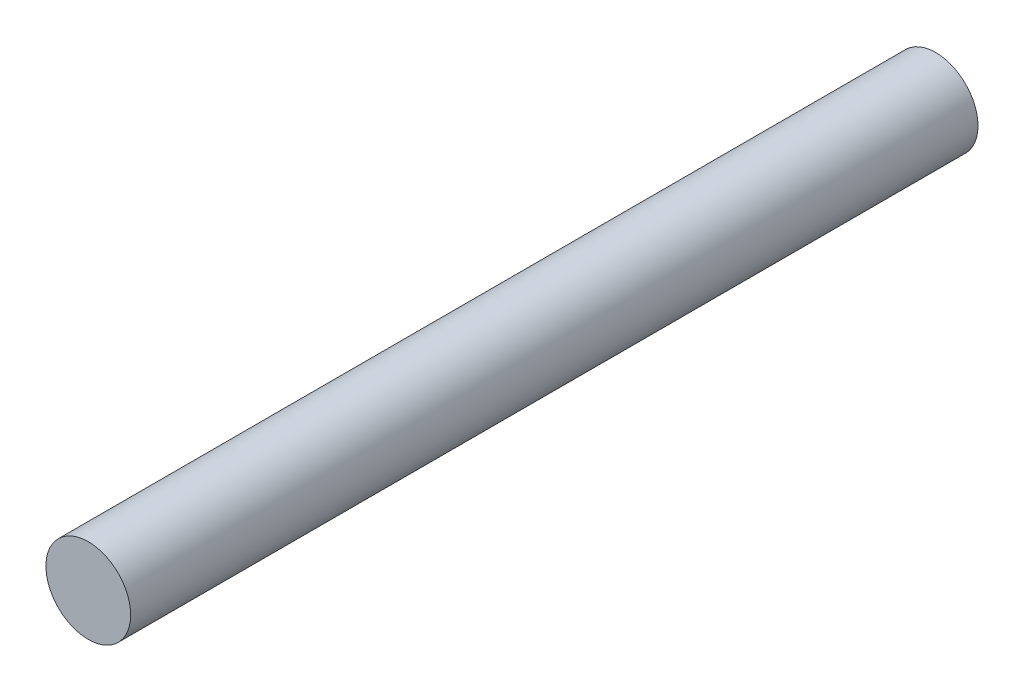
ISO-10303-21;
HEADER;
FILE_DESCRIPTION(('STEP AP214'),'2;1');
FILE_NAME('part.step','',(''),(''),'','','');
FILE_SCHEMA(('AUTOMOTIVE_DESIGN { 1 0 10303 214 1 1 1 1 }'));
ENDSEC;
DATA;
#1=APPLICATION_CONTEXT('core data for automotive mechanical design processes');
#2=APPLICATION_PROTOCOL_DEFINITION('international standard','automotive_design',2000,#1);
#3=PRODUCT_CONTEXT('',#1,'mechanical');
#4=PRODUCT('Part','Part','',(#3));
#5=PRODUCT_RELATED_PRODUCT_CATEGORY('part','',(#4));
#6=PRODUCT_DEFINITION_FORMATION('','',#4);
#7=PRODUCT_DEFINITION_CONTEXT('part definition',#1,'design');
#8=PRODUCT_DEFINITION('design','',#6,#7);
#9=PRODUCT_DEFINITION_SHAPE('','',#8);
#10=(LENGTH_UNIT() NAMED_UNIT(*) SI_UNIT(.MILLI.,.METRE.));
#11=(NAMED_UNIT(*) PLANE_ANGLE_UNIT() SI_UNIT($,.RADIAN.));
#12=(NAMED_UNIT(*) SI_UNIT($,.STERADIAN.) SOLID_ANGLE_UNIT());
#13=UNCERTAINTY_MEASURE_WITH_UNIT(LENGTH_MEASURE(1.E-05),#10,'distance_accuracy_value','');
#14=(GEOMETRIC_REPRESENTATION_CONTEXT(3) GLOBAL_UNCERTAINTY_ASSIGNED_CONTEXT((#13)) GLOBAL_UNIT_ASSIGNED_CONTEXT((#10,
#11,#12)) REPRESENTATION_CONTEXT('',''));
#15=CARTESIAN_POINT('',(0.,0.,0.));
#16=DIRECTION('',(0.,0.,1.));
#17=DIRECTION('',(1.,0.,0.));
#18=AXIS2_PLACEMENT_3D('',#15,#16,#17);
#19=CARTESIAN_POINT('',(0.,0.,152.4));
#20=DIRECTION('',(0.,0.,-1.));
#21=DIRECTION('',(-1.,0.,0.));
#22=AXIS2_PLACEMENT_3D('',#19,#20,#21);
#23=CYLINDRICAL_SURFACE('',#22,7.62);
#24=CARTESIAN_POINT('',(0.,0.,152.4));
#25=DIRECTION('',(0.,0.,1.));
#26=DIRECTION('',(1.,0.,0.));
#27=AXIS2_PLACEMENT_3D('',#24,#25,#26);
#28=CIRCLE('',#27,7.62);
#29=CARTESIAN_POINT('',(7.62,0.,152.4));
#30=VERTEX_POINT('',#29);
#31=EDGE_CURVE('E10',#30,#30,#28,.T.);
#32=ORIENTED_EDGE('',*,*,#31,.F.);
#33=EDGE_LOOP('',(#32));
#34=FACE_BOUND('',#33,.T.);
#35=CARTESIAN_POINT('',(0.,0.,0.));
#36=DIRECTION('',(0.,0.,1.));
#37=DIRECTION('',(1.,0.,0.));
#38=AXIS2_PLACEMENT_3D('',#35,#36,#37);
#39=CIRCLE('',#38,7.62);
#40=CARTESIAN_POINT('',(7.62,0.,0.));
#41=VERTEX_POINT('',#40);
#42=EDGE_CURVE('E44',#41,#41,#39,.T.);
#43=ORIENTED_EDGE('',*,*,#42,.T.);
#44=EDGE_LOOP('',(#43));
#45=FACE_BOUND('',#44,.T.);
#46=ADVANCED_FACE('F41',(#34,#45),#23,.T.);
#47=CARTESIAN_POINT('',(0.,0.,152.4));
#48=DIRECTION('',(0.,0.,1.));
#49=DIRECTION('',(1.,0.,0.));
#50=AXIS2_PLACEMENT_3D('',#47,#48,#49);
#51=PLANE('',#50);
#52=ORIENTED_EDGE('',*,*,#31,.T.);
#53=EDGE_LOOP('',(#52));
#54=FACE_BOUND('',#53,.T.);
#55=ADVANCED_FACE('F58',(#54),#51,.T.);
#56=CARTESIAN_POINT('',(0.,0.,0.));
#57=DIRECTION('',(0.,0.,1.));
#58=DIRECTION('',(1.,0.,0.));
#59=AXIS2_PLACEMENT_3D('',#56,#57,#58);
#60=PLANE('',#59);
#61=ORIENTED_EDGE('',*,*,#42,.F.);
#62=EDGE_LOOP('',(#61));
#63=FACE_BOUND('',#62,.T.);
#64=ADVANCED_FACE('F56',(#63),#60,.F.);
#65=CLOSED_SHELL('',(#46,#55,#64));
#66=MANIFOLD_SOLID_BREP('B2',#65);
#67=ADVANCED_BREP_SHAPE_REPRESENTATION('',(#18,#66),#14);
#68=SHAPE_DEFINITION_REPRESENTATION(#9,#67);
ENDSEC;
END-ISO-10303-21;
